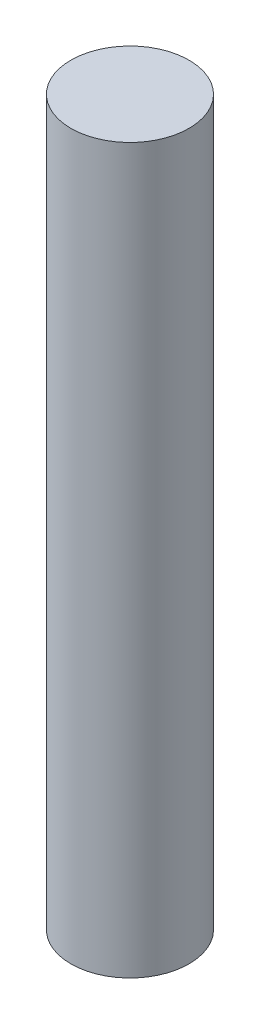
ISO-10303-21;
HEADER;
FILE_DESCRIPTION(('STEP AP214'),'2;1');
FILE_NAME('part.step','',(''),(''),'','','');
FILE_SCHEMA(('AUTOMOTIVE_DESIGN { 1 0 10303 214 1 1 1 1 }'));
ENDSEC;
DATA;
#1=APPLICATION_CONTEXT('core data for automotive mechanical design processes');
#2=APPLICATION_PROTOCOL_DEFINITION('international standard','automotive_design',2000,#1);
#3=PRODUCT_CONTEXT('',#1,'mechanical');
#4=PRODUCT('Part','Part','',(#3));
#5=PRODUCT_RELATED_PRODUCT_CATEGORY('part','',(#4));
#6=PRODUCT_DEFINITION_FORMATION('','',#4);
#7=PRODUCT_DEFINITION_CONTEXT('part definition',#1,'design');
#8=PRODUCT_DEFINITION('design','',#6,#7);
#9=PRODUCT_DEFINITION_SHAPE('','',#8);
#10=(LENGTH_UNIT() NAMED_UNIT(*) SI_UNIT(.MILLI.,.METRE.));
#11=(NAMED_UNIT(*) PLANE_ANGLE_UNIT() SI_UNIT($,.RADIAN.));
#12=(NAMED_UNIT(*) SI_UNIT($,.STERADIAN.) SOLID_ANGLE_UNIT());
#13=UNCERTAINTY_MEASURE_WITH_UNIT(LENGTH_MEASURE(1.E-05),#10,'distance_accuracy_value','');
#14=(GEOMETRIC_REPRESENTATION_CONTEXT(3) GLOBAL_UNCERTAINTY_ASSIGNED_CONTEXT((#13)) GLOBAL_UNIT_ASSIGNED_CONTEXT((#10,
#11,#12)) REPRESENTATION_CONTEXT('',''));
#15=CARTESIAN_POINT('',(0.,0.,0.));
#16=DIRECTION('',(0.,0.,1.));
#17=DIRECTION('',(1.,0.,0.));
#18=AXIS2_PLACEMENT_3D('',#15,#16,#17);
#19=CARTESIAN_POINT('',(0.,3.,0.));
#20=DIRECTION('',(0.,-1.,0.));
#21=DIRECTION('',(0.,0.,-1.));
#22=AXIS2_PLACEMENT_3D('',#19,#20,#21);
#23=CYLINDRICAL_SURFACE('',#22,0.245);
#24=CARTESIAN_POINT('',(0.,3.,0.));
#25=DIRECTION('',(0.,1.,0.));
#26=DIRECTION('',(0.,0.,1.));
#27=AXIS2_PLACEMENT_3D('',#24,#25,#26);
#28=CIRCLE('',#27,0.245);
#29=CARTESIAN_POINT('',(0.,3.,0.245));
#30=VERTEX_POINT('',#29);
#31=EDGE_CURVE('E10',#30,#30,#28,.T.);
#32=ORIENTED_EDGE('',*,*,#31,.F.);
#33=EDGE_LOOP('',(#32));
#34=FACE_BOUND('',#33,.T.);
#35=CARTESIAN_POINT('',(0.,0.,0.));
#36=DIRECTION('',(0.,1.,0.));
#37=DIRECTION('',(0.,0.,1.));
#38=AXIS2_PLACEMENT_3D('',#35,#36,#37);
#39=CIRCLE('',#38,0.245);
#40=CARTESIAN_POINT('',(0.,0.,0.245));
#41=VERTEX_POINT('',#40);
#42=EDGE_CURVE('E34',#41,#41,#39,.T.);
#43=ORIENTED_EDGE('',*,*,#42,.T.);
#44=EDGE_LOOP('',(#43));
#45=FACE_BOUND('',#44,.T.);
#46=ADVANCED_FACE('F31',(#34,#45),#23,.T.);
#47=CARTESIAN_POINT('',(0.,3.,0.));
#48=DIRECTION('',(0.,1.,0.));
#49=DIRECTION('',(0.,0.,1.));
#50=AXIS2_PLACEMENT_3D('',#47,#48,#49);
#51=PLANE('',#50);
#52=ORIENTED_EDGE('',*,*,#31,.T.);
#53=EDGE_LOOP('',(#52));
#54=FACE_BOUND('',#53,.T.);
#55=ADVANCED_FACE('F46',(#54),#51,.T.);
#56=CARTESIAN_POINT('',(0.,0.,0.));
#57=DIRECTION('',(0.,1.,0.));
#58=DIRECTION('',(0.,0.,1.));
#59=AXIS2_PLACEMENT_3D('',#56,#57,#58);
#60=PLANE('',#59);
#61=ORIENTED_EDGE('',*,*,#42,.F.);
#62=EDGE_LOOP('',(#61));
#63=FACE_BOUND('',#62,.T.);
#64=ADVANCED_FACE('F44',(#63),#60,.F.);
#65=CLOSED_SHELL('',(#46,#55,#64));
#66=MANIFOLD_SOLID_BREP('B2',#65);
#67=ADVANCED_BREP_SHAPE_REPRESENTATION('',(#18,#66),#14);
#68=SHAPE_DEFINITION_REPRESENTATION(#9,#67);
ENDSEC;
END-ISO-10303-21;
